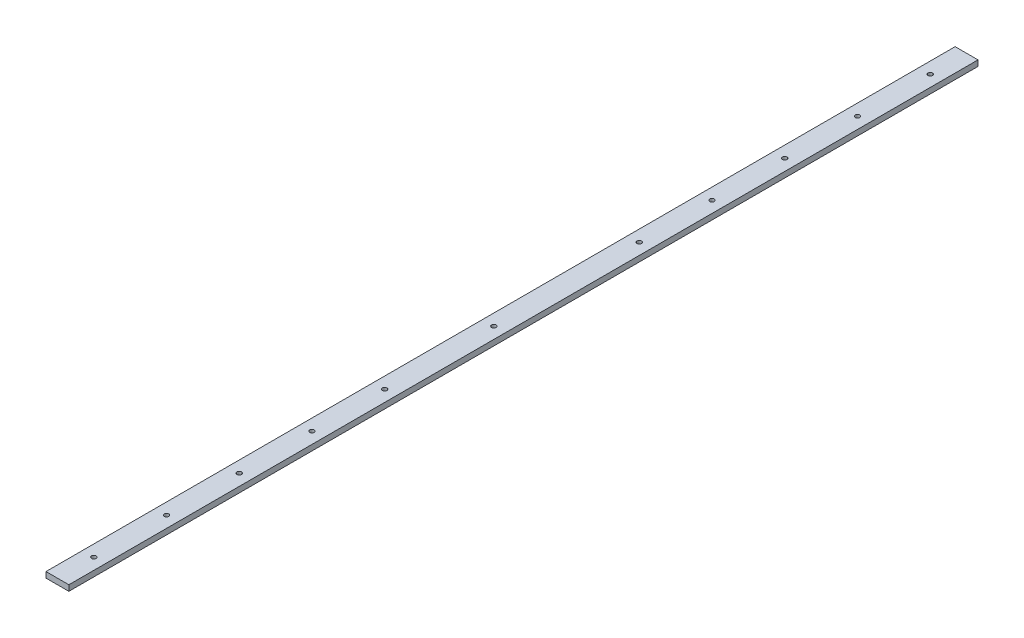
ISO-10303-21;
HEADER;
FILE_DESCRIPTION(('STEP AP214'),'2;1');
FILE_NAME('part.step','',(''),(''),'','','');
FILE_SCHEMA(('AUTOMOTIVE_DESIGN { 1 0 10303 214 1 1 1 1 }'));
ENDSEC;
DATA;
#1=APPLICATION_CONTEXT('core data for automotive mechanical design processes');
#2=APPLICATION_PROTOCOL_DEFINITION('international standard','automotive_design',2000,#1);
#3=PRODUCT_CONTEXT('',#1,'mechanical');
#4=PRODUCT('Part','Part','',(#3));
#5=PRODUCT_RELATED_PRODUCT_CATEGORY('part','',(#4));
#6=PRODUCT_DEFINITION_FORMATION('','',#4);
#7=PRODUCT_DEFINITION_CONTEXT('part definition',#1,'design');
#8=PRODUCT_DEFINITION('design','',#6,#7);
#9=PRODUCT_DEFINITION_SHAPE('','',#8);
#10=(LENGTH_UNIT() NAMED_UNIT(*) SI_UNIT(.MILLI.,.METRE.));
#11=(NAMED_UNIT(*) PLANE_ANGLE_UNIT() SI_UNIT($,.RADIAN.));
#12=(NAMED_UNIT(*) SI_UNIT($,.STERADIAN.) SOLID_ANGLE_UNIT());
#13=UNCERTAINTY_MEASURE_WITH_UNIT(LENGTH_MEASURE(1.E-05),#10,'distance_accuracy_value','');
#14=(GEOMETRIC_REPRESENTATION_CONTEXT(3) GLOBAL_UNCERTAINTY_ASSIGNED_CONTEXT((#13)) GLOBAL_UNIT_ASSIGNED_CONTEXT((#10,
#11,#12)) REPRESENTATION_CONTEXT('',''));
#15=CARTESIAN_POINT('',(0.,0.,0.));
#16=DIRECTION('',(0.,0.,1.));
#17=DIRECTION('',(1.,0.,0.));
#18=AXIS2_PLACEMENT_3D('',#15,#16,#17);
#19=CARTESIAN_POINT('',(0.,3.175,0.));
#20=DIRECTION('',(1.,0.,0.));
#21=DIRECTION('',(0.,0.,-1.));
#22=AXIS2_PLACEMENT_3D('',#19,#20,#21);
#23=PLANE('',#22);
#24=DIRECTION('',(0.,0.,1.));
#25=VECTOR('',#24,1.);
#26=CARTESIAN_POINT('',(0.,0.,0.));
#27=LINE('',#26,#25);
#28=CARTESIAN_POINT('',(0.,0.,-505.));
#29=VERTEX_POINT('',#28);
#30=CARTESIAN_POINT('',(0.,0.,0.));
#31=VERTEX_POINT('',#30);
#32=EDGE_CURVE('E99',#29,#31,#27,.T.);
#33=ORIENTED_EDGE('',*,*,#32,.T.);
#34=DIRECTION('',(0.,-1.,0.));
#35=VECTOR('',#34,1.);
#36=CARTESIAN_POINT('',(0.,3.175,0.));
#37=LINE('',#36,#35);
#38=CARTESIAN_POINT('',(0.,3.175,0.));
#39=VERTEX_POINT('',#38);
#40=EDGE_CURVE('E11',#39,#31,#37,.T.);
#41=ORIENTED_EDGE('',*,*,#40,.F.);
#42=DIRECTION('',(0.,0.,1.));
#43=VECTOR('',#42,1.);
#44=CARTESIAN_POINT('',(0.,3.175,0.));
#45=LINE('',#44,#43);
#46=CARTESIAN_POINT('',(0.,3.175,-505.));
#47=VERTEX_POINT('',#46);
#48=EDGE_CURVE('E86',#47,#39,#45,.T.);
#49=ORIENTED_EDGE('',*,*,#48,.F.);
#50=DIRECTION('',(0.,-1.,0.));
#51=VECTOR('',#50,1.);
#52=CARTESIAN_POINT('',(0.,3.175,-505.));
#53=LINE('',#52,#51);
#54=EDGE_CURVE('E95',#47,#29,#53,.T.);
#55=ORIENTED_EDGE('',*,*,#54,.T.);
#56=EDGE_LOOP('',(#33,#41,#49,#55));
#57=FACE_BOUND('',#56,.T.);
#58=ADVANCED_FACE('F33',(#57),#23,.F.);
#59=CARTESIAN_POINT('',(0.,3.175,0.));
#60=DIRECTION('',(0.,0.,-1.));
#61=DIRECTION('',(-1.,0.,0.));
#62=AXIS2_PLACEMENT_3D('',#59,#60,#61);
#63=PLANE('',#62);
#64=DIRECTION('',(1.,0.,0.));
#65=VECTOR('',#64,1.);
#66=CARTESIAN_POINT('',(0.,0.,0.));
#67=LINE('',#66,#65);
#68=CARTESIAN_POINT('',(12.7,0.,0.));
#69=VERTEX_POINT('',#68);
#70=EDGE_CURVE('E90',#31,#69,#67,.T.);
#71=ORIENTED_EDGE('',*,*,#70,.T.);
#72=DIRECTION('',(0.,-1.,0.));
#73=VECTOR('',#72,1.);
#74=CARTESIAN_POINT('',(12.7,3.175,0.));
#75=LINE('',#74,#73);
#76=CARTESIAN_POINT('',(12.7,3.175,0.));
#77=VERTEX_POINT('',#76);
#78=EDGE_CURVE('E42',#77,#69,#75,.T.);
#79=ORIENTED_EDGE('',*,*,#78,.F.);
#80=DIRECTION('',(1.,0.,0.));
#81=VECTOR('',#80,1.);
#82=CARTESIAN_POINT('',(0.,3.175,0.));
#83=LINE('',#82,#81);
#84=EDGE_CURVE('E81',#39,#77,#83,.T.);
#85=ORIENTED_EDGE('',*,*,#84,.F.);
#86=ORIENTED_EDGE('',*,*,#40,.T.);
#87=EDGE_LOOP('',(#71,#79,#85,#86));
#88=FACE_BOUND('',#87,.T.);
#89=ADVANCED_FACE('F89',(#88),#63,.F.);
#90=CARTESIAN_POINT('',(12.7,3.175,0.));
#91=DIRECTION('',(-1.,0.,0.));
#92=DIRECTION('',(0.,0.,1.));
#93=AXIS2_PLACEMENT_3D('',#90,#91,#92);
#94=PLANE('',#93);
#95=DIRECTION('',(0.,0.,-1.));
#96=VECTOR('',#95,1.);
#97=CARTESIAN_POINT('',(12.7,0.,0.));
#98=LINE('',#97,#96);
#99=CARTESIAN_POINT('',(12.7,0.,-505.));
#100=VERTEX_POINT('',#99);
#101=EDGE_CURVE('E68',#69,#100,#98,.T.);
#102=ORIENTED_EDGE('',*,*,#101,.T.);
#103=DIRECTION('',(0.,-1.,0.));
#104=VECTOR('',#103,1.);
#105=CARTESIAN_POINT('',(12.7,3.175,-505.));
#106=LINE('',#105,#104);
#107=CARTESIAN_POINT('',(12.7,3.175,-505.));
#108=VERTEX_POINT('',#107);
#109=EDGE_CURVE('E91',#108,#100,#106,.T.);
#110=ORIENTED_EDGE('',*,*,#109,.F.);
#111=DIRECTION('',(0.,0.,-1.));
#112=VECTOR('',#111,1.);
#113=CARTESIAN_POINT('',(12.7,3.175,0.));
#114=LINE('',#113,#112);
#115=EDGE_CURVE('E84',#77,#108,#114,.T.);
#116=ORIENTED_EDGE('',*,*,#115,.F.);
#117=ORIENTED_EDGE('',*,*,#78,.T.);
#118=EDGE_LOOP('',(#102,#110,#116,#117));
#119=FACE_BOUND('',#118,.T.);
#120=ADVANCED_FACE('F93',(#119),#94,.F.);
#121=CARTESIAN_POINT('',(0.,3.175,-505.));
#122=DIRECTION('',(0.,0.,1.));
#123=DIRECTION('',(1.,0.,0.));
#124=AXIS2_PLACEMENT_3D('',#121,#122,#123);
#125=PLANE('',#124);
#126=DIRECTION('',(-1.,0.,0.));
#127=VECTOR('',#126,1.);
#128=CARTESIAN_POINT('',(0.,0.,-505.));
#129=LINE('',#128,#127);
#130=EDGE_CURVE('E74',#100,#29,#129,.T.);
#131=ORIENTED_EDGE('',*,*,#130,.T.);
#132=ORIENTED_EDGE('',*,*,#54,.F.);
#133=DIRECTION('',(-1.,0.,0.));
#134=VECTOR('',#133,1.);
#135=CARTESIAN_POINT('',(0.,3.175,-505.));
#136=LINE('',#135,#134);
#137=EDGE_CURVE('E51',#108,#47,#136,.T.);
#138=ORIENTED_EDGE('',*,*,#137,.F.);
#139=ORIENTED_EDGE('',*,*,#109,.T.);
#140=EDGE_LOOP('',(#131,#132,#138,#139));
#141=FACE_BOUND('',#140,.T.);
#142=ADVANCED_FACE('F168',(#141),#125,.F.);
#143=CARTESIAN_POINT('',(0.,3.175,0.));
#144=DIRECTION('',(0.,-1.,0.));
#145=DIRECTION('',(0.,0.,-1.));
#146=AXIS2_PLACEMENT_3D('',#143,#144,#145);
#147=PLANE('',#146);
#148=CARTESIAN_POINT('',(6.35,3.175,-20.2));
#149=DIRECTION('',(0.,1.,0.));
#150=DIRECTION('',(0.,0.,1.));
#151=AXIS2_PLACEMENT_3D('',#148,#149,#150);
#152=CIRCLE('',#151,1.24999999999999);
#153=CARTESIAN_POINT('',(6.35,3.175,-18.95));
#154=VERTEX_POINT('',#153);
#155=EDGE_CURVE('E321',#154,#154,#152,.T.);
#156=ORIENTED_EDGE('',*,*,#155,.F.);
#157=EDGE_LOOP('',(#156));
#158=FACE_BOUND('',#157,.T.);
#159=CARTESIAN_POINT('',(6.34999999999986,3.175,-60.6));
#160=DIRECTION('',(0.,1.,0.));
#161=DIRECTION('',(0.,0.,1.));
#162=AXIS2_PLACEMENT_3D('',#159,#160,#161);
#163=CIRCLE('',#162,1.24999999999999);
#164=CARTESIAN_POINT('',(6.34999999999986,3.175,-59.35));
#165=VERTEX_POINT('',#164);
#166=EDGE_CURVE('E323',#165,#165,#163,.T.);
#167=ORIENTED_EDGE('',*,*,#166,.F.);
#168=EDGE_LOOP('',(#167));
#169=FACE_BOUND('',#168,.T.);
#170=CARTESIAN_POINT('',(6.34999999999972,3.175,-101.));
#171=DIRECTION('',(0.,1.,0.));
#172=DIRECTION('',(0.,0.,1.));
#173=AXIS2_PLACEMENT_3D('',#170,#171,#172);
#174=CIRCLE('',#173,1.24999999999999);
#175=CARTESIAN_POINT('',(6.34999999999972,3.175,-99.75));
#176=VERTEX_POINT('',#175);
#177=EDGE_CURVE('E331',#176,#176,#174,.T.);
#178=ORIENTED_EDGE('',*,*,#177,.F.);
#179=EDGE_LOOP('',(#178));
#180=FACE_BOUND('',#179,.T.);
#181=CARTESIAN_POINT('',(6.34999999999958,3.175,-141.4));
#182=DIRECTION('',(0.,1.,0.));
#183=DIRECTION('',(0.,0.,1.));
#184=AXIS2_PLACEMENT_3D('',#181,#182,#183);
#185=CIRCLE('',#184,1.24999999999999);
#186=CARTESIAN_POINT('',(6.34999999999958,3.175,-140.15));
#187=VERTEX_POINT('',#186);
#188=EDGE_CURVE('E127',#187,#187,#185,.T.);
#189=ORIENTED_EDGE('',*,*,#188,.F.);
#190=EDGE_LOOP('',(#189));
#191=FACE_BOUND('',#190,.T.);
#192=CARTESIAN_POINT('',(6.34999999999943,3.175,-181.8));
#193=DIRECTION('',(0.,1.,0.));
#194=DIRECTION('',(0.,0.,1.));
#195=AXIS2_PLACEMENT_3D('',#192,#193,#194);
#196=CIRCLE('',#195,1.24999999999999);
#197=CARTESIAN_POINT('',(6.34999999999943,3.175,-180.55));
#198=VERTEX_POINT('',#197);
#199=EDGE_CURVE('E115',#198,#198,#196,.T.);
#200=ORIENTED_EDGE('',*,*,#199,.F.);
#201=EDGE_LOOP('',(#200));
#202=FACE_BOUND('',#201,.T.);
#203=CARTESIAN_POINT('',(6.34999999999922,3.175,-242.4));
#204=DIRECTION('',(0.,1.,0.));
#205=DIRECTION('',(0.,0.,1.));
#206=AXIS2_PLACEMENT_3D('',#203,#204,#205);
#207=CIRCLE('',#206,1.24999999999999);
#208=CARTESIAN_POINT('',(6.34999999999922,3.175,-241.15));
#209=VERTEX_POINT('',#208);
#210=EDGE_CURVE('E114',#209,#209,#207,.T.);
#211=ORIENTED_EDGE('',*,*,#210,.F.);
#212=EDGE_LOOP('',(#211));
#213=FACE_BOUND('',#212,.T.);
#214=CARTESIAN_POINT('',(6.34999999999894,3.175,-323.2));
#215=DIRECTION('',(0.,1.,0.));
#216=DIRECTION('',(0.,0.,1.));
#217=AXIS2_PLACEMENT_3D('',#214,#215,#216);
#218=CIRCLE('',#217,1.24999999999999);
#219=CARTESIAN_POINT('',(6.34999999999894,3.175,-321.95));
#220=VERTEX_POINT('',#219);
#221=EDGE_CURVE('E133',#220,#220,#218,.T.);
#222=ORIENTED_EDGE('',*,*,#221,.F.);
#223=EDGE_LOOP('',(#222));
#224=FACE_BOUND('',#223,.T.);
#225=CARTESIAN_POINT('',(6.3499999999988,3.175,-363.6));
#226=DIRECTION('',(0.,1.,0.));
#227=DIRECTION('',(0.,0.,1.));
#228=AXIS2_PLACEMENT_3D('',#225,#226,#227);
#229=CIRCLE('',#228,1.24999999999999);
#230=CARTESIAN_POINT('',(6.3499999999988,3.175,-362.35));
#231=VERTEX_POINT('',#230);
#232=EDGE_CURVE('E139',#231,#231,#229,.T.);
#233=ORIENTED_EDGE('',*,*,#232,.F.);
#234=EDGE_LOOP('',(#233));
#235=FACE_BOUND('',#234,.T.);
#236=CARTESIAN_POINT('',(6.34999999999866,3.175,-404.));
#237=DIRECTION('',(0.,1.,0.));
#238=DIRECTION('',(0.,0.,1.));
#239=AXIS2_PLACEMENT_3D('',#236,#237,#238);
#240=CIRCLE('',#239,1.24999999999999);
#241=CARTESIAN_POINT('',(6.34999999999866,3.175,-402.75));
#242=VERTEX_POINT('',#241);
#243=EDGE_CURVE('E111',#242,#242,#240,.T.);
#244=ORIENTED_EDGE('',*,*,#243,.F.);
#245=EDGE_LOOP('',(#244));
#246=FACE_BOUND('',#245,.T.);
#247=CARTESIAN_POINT('',(6.34999999999852,3.175,-444.4));
#248=DIRECTION('',(0.,1.,0.));
#249=DIRECTION('',(0.,0.,1.));
#250=AXIS2_PLACEMENT_3D('',#247,#248,#249);
#251=CIRCLE('',#250,1.24999999999999);
#252=CARTESIAN_POINT('',(6.34999999999852,3.175,-443.15));
#253=VERTEX_POINT('',#252);
#254=EDGE_CURVE('E110',#253,#253,#251,.T.);
#255=ORIENTED_EDGE('',*,*,#254,.F.);
#256=EDGE_LOOP('',(#255));
#257=FACE_BOUND('',#256,.T.);
#258=CARTESIAN_POINT('',(6.34999999999838,3.175,-484.8));
#259=DIRECTION('',(0.,1.,0.));
#260=DIRECTION('',(0.,0.,1.));
#261=AXIS2_PLACEMENT_3D('',#258,#259,#260);
#262=CIRCLE('',#261,1.24999999999999);
#263=CARTESIAN_POINT('',(6.34999999999838,3.175,-483.55));
#264=VERTEX_POINT('',#263);
#265=EDGE_CURVE('E152',#264,#264,#262,.T.);
#266=ORIENTED_EDGE('',*,*,#265,.F.);
#267=EDGE_LOOP('',(#266));
#268=FACE_BOUND('',#267,.T.);
#269=ORIENTED_EDGE('',*,*,#48,.T.);
#270=ORIENTED_EDGE('',*,*,#84,.T.);
#271=ORIENTED_EDGE('',*,*,#115,.T.);
#272=ORIENTED_EDGE('',*,*,#137,.T.);
#273=EDGE_LOOP('',(#269,#270,#271,#272));
#274=FACE_BOUND('',#273,.T.);
#275=ADVANCED_FACE('F82',(#158,#169,#180,#191,#202,#213,#224,#235,#246,#257,#268,#274),#147,.F.);
#276=CARTESIAN_POINT('',(0.,0.,0.));
#277=DIRECTION('',(0.,-1.,0.));
#278=DIRECTION('',(0.,0.,-1.));
#279=AXIS2_PLACEMENT_3D('',#276,#277,#278);
#280=PLANE('',#279);
#281=CARTESIAN_POINT('',(6.35,0.,-20.2));
#282=DIRECTION('',(0.,-1.,0.));
#283=DIRECTION('',(0.,0.,-1.));
#284=AXIS2_PLACEMENT_3D('',#281,#282,#283);
#285=CIRCLE('',#284,1.24999999999999);
#286=CARTESIAN_POINT('',(6.35,0.,-21.45));
#287=VERTEX_POINT('',#286);
#288=EDGE_CURVE('E318',#287,#287,#285,.T.);
#289=ORIENTED_EDGE('',*,*,#288,.F.);
#290=EDGE_LOOP('',(#289));
#291=FACE_BOUND('',#290,.T.);
#292=CARTESIAN_POINT('',(6.34999999999986,0.,-60.6));
#293=DIRECTION('',(0.,-1.,0.));
#294=DIRECTION('',(0.,0.,-1.));
#295=AXIS2_PLACEMENT_3D('',#292,#293,#294);
#296=CIRCLE('',#295,1.24999999999999);
#297=CARTESIAN_POINT('',(6.34999999999986,0.,-61.85));
#298=VERTEX_POINT('',#297);
#299=EDGE_CURVE('E328',#298,#298,#296,.T.);
#300=ORIENTED_EDGE('',*,*,#299,.F.);
#301=EDGE_LOOP('',(#300));
#302=FACE_BOUND('',#301,.T.);
#303=CARTESIAN_POINT('',(6.34999999999972,0.,-101.));
#304=DIRECTION('',(0.,-1.,0.));
#305=DIRECTION('',(0.,0.,-1.));
#306=AXIS2_PLACEMENT_3D('',#303,#304,#305);
#307=CIRCLE('',#306,1.24999999999999);
#308=CARTESIAN_POINT('',(6.34999999999972,0.,-102.25));
#309=VERTEX_POINT('',#308);
#310=EDGE_CURVE('E36',#309,#309,#307,.T.);
#311=ORIENTED_EDGE('',*,*,#310,.F.);
#312=EDGE_LOOP('',(#311));
#313=FACE_BOUND('',#312,.T.);
#314=CARTESIAN_POINT('',(6.34999999999958,0.,-141.4));
#315=DIRECTION('',(0.,-1.,0.));
#316=DIRECTION('',(0.,0.,-1.));
#317=AXIS2_PLACEMENT_3D('',#314,#315,#316);
#318=CIRCLE('',#317,1.24999999999999);
#319=CARTESIAN_POINT('',(6.34999999999958,0.,-142.65));
#320=VERTEX_POINT('',#319);
#321=EDGE_CURVE('E122',#320,#320,#318,.T.);
#322=ORIENTED_EDGE('',*,*,#321,.F.);
#323=EDGE_LOOP('',(#322));
#324=FACE_BOUND('',#323,.T.);
#325=CARTESIAN_POINT('',(6.34999999999943,0.,-181.8));
#326=DIRECTION('',(0.,-1.,0.));
#327=DIRECTION('',(0.,0.,-1.));
#328=AXIS2_PLACEMENT_3D('',#325,#326,#327);
#329=CIRCLE('',#328,1.24999999999999);
#330=CARTESIAN_POINT('',(6.34999999999943,0.,-183.05));
#331=VERTEX_POINT('',#330);
#332=EDGE_CURVE('E112',#331,#331,#329,.T.);
#333=ORIENTED_EDGE('',*,*,#332,.F.);
#334=EDGE_LOOP('',(#333));
#335=FACE_BOUND('',#334,.T.);
#336=CARTESIAN_POINT('',(6.34999999999922,0.,-242.4));
#337=DIRECTION('',(0.,-1.,0.));
#338=DIRECTION('',(0.,0.,-1.));
#339=AXIS2_PLACEMENT_3D('',#336,#337,#338);
#340=CIRCLE('',#339,1.24999999999999);
#341=CARTESIAN_POINT('',(6.34999999999922,0.,-243.65));
#342=VERTEX_POINT('',#341);
#343=EDGE_CURVE('E119',#342,#342,#340,.T.);
#344=ORIENTED_EDGE('',*,*,#343,.F.);
#345=EDGE_LOOP('',(#344));
#346=FACE_BOUND('',#345,.T.);
#347=CARTESIAN_POINT('',(6.34999999999894,0.,-323.2));
#348=DIRECTION('',(0.,-1.,0.));
#349=DIRECTION('',(0.,0.,-1.));
#350=AXIS2_PLACEMENT_3D('',#347,#348,#349);
#351=CIRCLE('',#350,1.24999999999999);
#352=CARTESIAN_POINT('',(6.34999999999894,0.,-324.45));
#353=VERTEX_POINT('',#352);
#354=EDGE_CURVE('E136',#353,#353,#351,.T.);
#355=ORIENTED_EDGE('',*,*,#354,.F.);
#356=EDGE_LOOP('',(#355));
#357=FACE_BOUND('',#356,.T.);
#358=CARTESIAN_POINT('',(6.3499999999988,0.,-363.6));
#359=DIRECTION('',(0.,-1.,0.));
#360=DIRECTION('',(0.,0.,-1.));
#361=AXIS2_PLACEMENT_3D('',#358,#359,#360);
#362=CIRCLE('',#361,1.24999999999999);
#363=CARTESIAN_POINT('',(6.3499999999988,0.,-364.85));
#364=VERTEX_POINT('',#363);
#365=EDGE_CURVE('E142',#364,#364,#362,.T.);
#366=ORIENTED_EDGE('',*,*,#365,.F.);
#367=EDGE_LOOP('',(#366));
#368=FACE_BOUND('',#367,.T.);
#369=CARTESIAN_POINT('',(6.34999999999866,0.,-404.));
#370=DIRECTION('',(0.,-1.,0.));
#371=DIRECTION('',(0.,0.,-1.));
#372=AXIS2_PLACEMENT_3D('',#369,#370,#371);
#373=CIRCLE('',#372,1.24999999999999);
#374=CARTESIAN_POINT('',(6.34999999999866,0.,-405.25));
#375=VERTEX_POINT('',#374);
#376=EDGE_CURVE('E108',#375,#375,#373,.T.);
#377=ORIENTED_EDGE('',*,*,#376,.F.);
#378=EDGE_LOOP('',(#377));
#379=FACE_BOUND('',#378,.T.);
#380=CARTESIAN_POINT('',(6.34999999999852,0.,-444.4));
#381=DIRECTION('',(0.,-1.,0.));
#382=DIRECTION('',(0.,0.,-1.));
#383=AXIS2_PLACEMENT_3D('',#380,#381,#382);
#384=CIRCLE('',#383,1.24999999999999);
#385=CARTESIAN_POINT('',(6.34999999999852,0.,-445.65));
#386=VERTEX_POINT('',#385);
#387=EDGE_CURVE('E149',#386,#386,#384,.T.);
#388=ORIENTED_EDGE('',*,*,#387,.F.);
#389=EDGE_LOOP('',(#388));
#390=FACE_BOUND('',#389,.T.);
#391=CARTESIAN_POINT('',(6.34999999999838,0.,-484.8));
#392=DIRECTION('',(0.,-1.,0.));
#393=DIRECTION('',(0.,0.,-1.));
#394=AXIS2_PLACEMENT_3D('',#391,#392,#393);
#395=CIRCLE('',#394,1.24999999999999);
#396=CARTESIAN_POINT('',(6.34999999999838,0.,-486.05));
#397=VERTEX_POINT('',#396);
#398=EDGE_CURVE('E102',#397,#397,#395,.T.);
#399=ORIENTED_EDGE('',*,*,#398,.F.);
#400=EDGE_LOOP('',(#399));
#401=FACE_BOUND('',#400,.T.);
#402=ORIENTED_EDGE('',*,*,#32,.F.);
#403=ORIENTED_EDGE('',*,*,#130,.F.);
#404=ORIENTED_EDGE('',*,*,#101,.F.);
#405=ORIENTED_EDGE('',*,*,#70,.F.);
#406=EDGE_LOOP('',(#402,#403,#404,#405));
#407=FACE_BOUND('',#406,.T.);
#408=ADVANCED_FACE('F161',(#291,#302,#313,#324,#335,#346,#357,#368,#379,#390,#401,#407),#280,.T.);
#409=CARTESIAN_POINT('',(6.34999999999838,3.175,-484.8));
#410=DIRECTION('',(0.,1.,0.));
#411=DIRECTION('',(0.,0.,1.));
#412=AXIS2_PLACEMENT_3D('',#409,#410,#411);
#413=CYLINDRICAL_SURFACE('',#412,1.24999999999999);
#414=ORIENTED_EDGE('',*,*,#398,.T.);
#415=EDGE_LOOP('',(#414));
#416=FACE_BOUND('',#415,.T.);
#417=ORIENTED_EDGE('',*,*,#265,.T.);
#418=EDGE_LOOP('',(#417));
#419=FACE_BOUND('',#418,.T.);
#420=ADVANCED_FACE('F158',(#416,#419),#413,.F.);
#421=CARTESIAN_POINT('',(6.34999999999852,3.175,-444.4));
#422=DIRECTION('',(0.,1.,0.));
#423=DIRECTION('',(0.,0.,1.));
#424=AXIS2_PLACEMENT_3D('',#421,#422,#423);
#425=CYLINDRICAL_SURFACE('',#424,1.24999999999999);
#426=ORIENTED_EDGE('',*,*,#387,.T.);
#427=EDGE_LOOP('',(#426));
#428=FACE_BOUND('',#427,.T.);
#429=ORIENTED_EDGE('',*,*,#254,.T.);
#430=EDGE_LOOP('',(#429));
#431=FACE_BOUND('',#430,.T.);
#432=ADVANCED_FACE('F213',(#428,#431),#425,.F.);
#433=CARTESIAN_POINT('',(6.34999999999866,3.175,-404.));
#434=DIRECTION('',(0.,1.,0.));
#435=DIRECTION('',(0.,0.,1.));
#436=AXIS2_PLACEMENT_3D('',#433,#434,#435);
#437=CYLINDRICAL_SURFACE('',#436,1.24999999999999);
#438=ORIENTED_EDGE('',*,*,#376,.T.);
#439=EDGE_LOOP('',(#438));
#440=FACE_BOUND('',#439,.T.);
#441=ORIENTED_EDGE('',*,*,#243,.T.);
#442=EDGE_LOOP('',(#441));
#443=FACE_BOUND('',#442,.T.);
#444=ADVANCED_FACE('F222',(#440,#443),#437,.F.);
#445=CARTESIAN_POINT('',(6.3499999999988,3.175,-363.6));
#446=DIRECTION('',(0.,1.,0.));
#447=DIRECTION('',(0.,0.,1.));
#448=AXIS2_PLACEMENT_3D('',#445,#446,#447);
#449=CYLINDRICAL_SURFACE('',#448,1.24999999999999);
#450=ORIENTED_EDGE('',*,*,#365,.T.);
#451=EDGE_LOOP('',(#450));
#452=FACE_BOUND('',#451,.T.);
#453=ORIENTED_EDGE('',*,*,#232,.T.);
#454=EDGE_LOOP('',(#453));
#455=FACE_BOUND('',#454,.T.);
#456=ADVANCED_FACE('F232',(#452,#455),#449,.F.);
#457=CARTESIAN_POINT('',(6.34999999999894,3.175,-323.2));
#458=DIRECTION('',(0.,1.,0.));
#459=DIRECTION('',(0.,0.,1.));
#460=AXIS2_PLACEMENT_3D('',#457,#458,#459);
#461=CYLINDRICAL_SURFACE('',#460,1.24999999999999);
#462=ORIENTED_EDGE('',*,*,#354,.T.);
#463=EDGE_LOOP('',(#462));
#464=FACE_BOUND('',#463,.T.);
#465=ORIENTED_EDGE('',*,*,#221,.T.);
#466=EDGE_LOOP('',(#465));
#467=FACE_BOUND('',#466,.T.);
#468=ADVANCED_FACE('F242',(#464,#467),#461,.F.);
#469=CARTESIAN_POINT('',(6.34999999999922,3.175,-242.4));
#470=DIRECTION('',(0.,1.,0.));
#471=DIRECTION('',(0.,0.,1.));
#472=AXIS2_PLACEMENT_3D('',#469,#470,#471);
#473=CYLINDRICAL_SURFACE('',#472,1.24999999999999);
#474=ORIENTED_EDGE('',*,*,#343,.T.);
#475=EDGE_LOOP('',(#474));
#476=FACE_BOUND('',#475,.T.);
#477=ORIENTED_EDGE('',*,*,#210,.T.);
#478=EDGE_LOOP('',(#477));
#479=FACE_BOUND('',#478,.T.);
#480=ADVANCED_FACE('F252',(#476,#479),#473,.F.);
#481=CARTESIAN_POINT('',(6.34999999999943,3.175,-181.8));
#482=DIRECTION('',(0.,1.,0.));
#483=DIRECTION('',(0.,0.,1.));
#484=AXIS2_PLACEMENT_3D('',#481,#482,#483);
#485=CYLINDRICAL_SURFACE('',#484,1.24999999999999);
#486=ORIENTED_EDGE('',*,*,#332,.T.);
#487=EDGE_LOOP('',(#486));
#488=FACE_BOUND('',#487,.T.);
#489=ORIENTED_EDGE('',*,*,#199,.T.);
#490=EDGE_LOOP('',(#489));
#491=FACE_BOUND('',#490,.T.);
#492=ADVANCED_FACE('F262',(#488,#491),#485,.F.);
#493=CARTESIAN_POINT('',(6.34999999999958,3.175,-141.4));
#494=DIRECTION('',(0.,1.,0.));
#495=DIRECTION('',(0.,0.,1.));
#496=AXIS2_PLACEMENT_3D('',#493,#494,#495);
#497=CYLINDRICAL_SURFACE('',#496,1.24999999999999);
#498=ORIENTED_EDGE('',*,*,#321,.T.);
#499=EDGE_LOOP('',(#498));
#500=FACE_BOUND('',#499,.T.);
#501=ORIENTED_EDGE('',*,*,#188,.T.);
#502=EDGE_LOOP('',(#501));
#503=FACE_BOUND('',#502,.T.);
#504=ADVANCED_FACE('F272',(#500,#503),#497,.F.);
#505=CARTESIAN_POINT('',(6.34999999999972,3.175,-101.));
#506=DIRECTION('',(0.,1.,0.));
#507=DIRECTION('',(0.,0.,1.));
#508=AXIS2_PLACEMENT_3D('',#505,#506,#507);
#509=CYLINDRICAL_SURFACE('',#508,1.24999999999999);
#510=ORIENTED_EDGE('',*,*,#310,.T.);
#511=EDGE_LOOP('',(#510));
#512=FACE_BOUND('',#511,.T.);
#513=ORIENTED_EDGE('',*,*,#177,.T.);
#514=EDGE_LOOP('',(#513));
#515=FACE_BOUND('',#514,.T.);
#516=ADVANCED_FACE('F281',(#512,#515),#509,.F.);
#517=CARTESIAN_POINT('',(6.34999999999986,3.175,-60.6));
#518=DIRECTION('',(0.,1.,0.));
#519=DIRECTION('',(0.,0.,1.));
#520=AXIS2_PLACEMENT_3D('',#517,#518,#519);
#521=CYLINDRICAL_SURFACE('',#520,1.24999999999999);
#522=ORIENTED_EDGE('',*,*,#299,.T.);
#523=EDGE_LOOP('',(#522));
#524=FACE_BOUND('',#523,.T.);
#525=ORIENTED_EDGE('',*,*,#166,.T.);
#526=EDGE_LOOP('',(#525));
#527=FACE_BOUND('',#526,.T.);
#528=ADVANCED_FACE('F291',(#524,#527),#521,.F.);
#529=CARTESIAN_POINT('',(6.35,3.175,-20.2));
#530=DIRECTION('',(0.,1.,0.));
#531=DIRECTION('',(0.,0.,1.));
#532=AXIS2_PLACEMENT_3D('',#529,#530,#531);
#533=CYLINDRICAL_SURFACE('',#532,1.24999999999999);
#534=ORIENTED_EDGE('',*,*,#288,.T.);
#535=EDGE_LOOP('',(#534));
#536=FACE_BOUND('',#535,.T.);
#537=ORIENTED_EDGE('',*,*,#155,.T.);
#538=EDGE_LOOP('',(#537));
#539=FACE_BOUND('',#538,.T.);
#540=ADVANCED_FACE('F301',(#536,#539),#533,.F.);
#541=CLOSED_SHELL('',(#58,#89,#120,#142,#275,#408,#420,#432,#444,#456,#468,#480,#492,#504,#516,
#528,#540));
#542=MANIFOLD_SOLID_BREP('B2',#541);
#543=ADVANCED_BREP_SHAPE_REPRESENTATION('',(#18,#542),#14);
#544=SHAPE_DEFINITION_REPRESENTATION(#9,#543);
ENDSEC;
END-ISO-10303-21;
